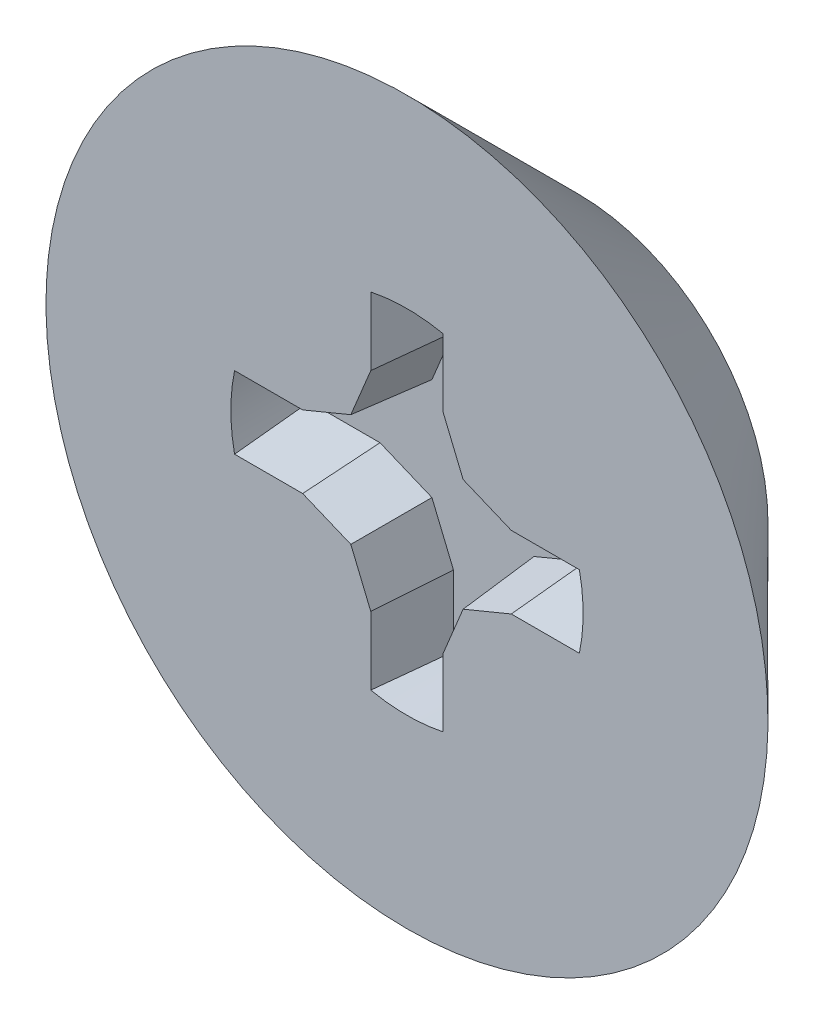
ISO-10303-21;
HEADER;
FILE_DESCRIPTION(('STEP AP214'),'2;1');
FILE_NAME('part.step','',(''),(''),'','','');
FILE_SCHEMA(('AUTOMOTIVE_DESIGN { 1 0 10303 214 1 1 1 1 }'));
ENDSEC;
DATA;
#1=APPLICATION_CONTEXT('core data for automotive mechanical design processes');
#2=APPLICATION_PROTOCOL_DEFINITION('international standard','automotive_design',2000,#1);
#3=PRODUCT_CONTEXT('',#1,'mechanical');
#4=PRODUCT('Part','Part','',(#3));
#5=PRODUCT_RELATED_PRODUCT_CATEGORY('part','',(#4));
#6=PRODUCT_DEFINITION_FORMATION('','',#4);
#7=PRODUCT_DEFINITION_CONTEXT('part definition',#1,'design');
#8=PRODUCT_DEFINITION('design','',#6,#7);
#9=PRODUCT_DEFINITION_SHAPE('','',#8);
#10=(LENGTH_UNIT() NAMED_UNIT(*) SI_UNIT(.MILLI.,.METRE.));
#11=(NAMED_UNIT(*) PLANE_ANGLE_UNIT() SI_UNIT($,.RADIAN.));
#12=(NAMED_UNIT(*) SI_UNIT($,.STERADIAN.) SOLID_ANGLE_UNIT());
#13=UNCERTAINTY_MEASURE_WITH_UNIT(LENGTH_MEASURE(1.E-05),#10,'distance_accuracy_value','');
#14=(GEOMETRIC_REPRESENTATION_CONTEXT(3) GLOBAL_UNCERTAINTY_ASSIGNED_CONTEXT((#13)) GLOBAL_UNIT_ASSIGNED_CONTEXT((#10,
#11,#12)) REPRESENTATION_CONTEXT('',''));
#15=CARTESIAN_POINT('',(0.,0.,0.));
#16=DIRECTION('',(0.,0.,1.));
#17=DIRECTION('',(1.,0.,0.));
#18=AXIS2_PLACEMENT_3D('',#15,#16,#17);
#19=CARTESIAN_POINT('',(0.,0.,1.2));
#20=DIRECTION('',(0.,0.,-1.));
#21=DIRECTION('',(0.,1.,0.));
#22=AXIS2_PLACEMENT_3D('',#19,#20,#21);
#23=PLANE('',#22);
#24=CARTESIAN_POINT('',(0.,0.,1.2));
#25=DIRECTION('',(0.,0.,1.));
#26=DIRECTION('',(0.,-1.,0.));
#27=AXIS2_PLACEMENT_3D('',#24,#25,#26);
#28=CIRCLE('',#27,1.9);
#29=CARTESIAN_POINT('',(0.,-1.9,1.2));
#30=VERTEX_POINT('',#29);
#31=EDGE_CURVE('E49',#30,#30,#28,.T.);
#32=ORIENTED_EDGE('',*,*,#31,.T.);
#33=EDGE_LOOP('',(#32));
#34=FACE_BOUND('',#33,.T.);
#35=CARTESIAN_POINT('',(0.,0.,1.2));
#36=DIRECTION('',(0.,0.,1.));
#37=DIRECTION('',(1.,0.,0.));
#38=AXIS2_PLACEMENT_3D('',#35,#36,#37);
#39=CIRCLE('',#38,0.927100000000001);
#40=CARTESIAN_POINT('',(0.90731701185418,-0.190500000000004,1.2));
#41=VERTEX_POINT('',#40);
#42=CARTESIAN_POINT('',(0.907317011854182,0.190500000000001,1.2));
#43=VERTEX_POINT('',#42);
#44=EDGE_CURVE('E260',#41,#43,#39,.T.);
#45=ORIENTED_EDGE('',*,*,#44,.F.);
#46=DIRECTION('',(-1.,0.,0.));
#47=VECTOR('',#46,1.);
#48=CARTESIAN_POINT('',(0.,-0.190500000000001,1.2));
#49=LINE('',#48,#47);
#50=CARTESIAN_POINT('',(0.54890850592709,-0.190500000000003,1.2));
#51=VERTEX_POINT('',#50);
#52=EDGE_CURVE('E251',#41,#51,#49,.T.);
#53=ORIENTED_EDGE('',*,*,#52,.T.);
#54=DIRECTION('',(-0.923879532511288,-0.382683432365088,0.));
#55=VECTOR('',#54,1.);
#56=CARTESIAN_POINT('',(0.147737710475553,-0.356670384304032,1.2));
#57=LINE('',#56,#55);
#58=CARTESIAN_POINT('',(0.295475420951106,-0.295475420951108,1.2));
#59=VERTEX_POINT('',#58);
#60=EDGE_CURVE('E247',#51,#59,#57,.T.);
#61=ORIENTED_EDGE('',*,*,#60,.T.);
#62=DIRECTION('',(-0.382683432365094,-0.923879532511285,0.));
#63=VECTOR('',#62,1.);
#64=CARTESIAN_POINT('',(0.356670384304031,-0.147737710475555,1.2));
#65=LINE('',#64,#63);
#66=CARTESIAN_POINT('',(0.190499999999999,-0.548908505927092,1.2));
#67=VERTEX_POINT('',#66);
#68=EDGE_CURVE('E243',#59,#67,#65,.T.);
#69=ORIENTED_EDGE('',*,*,#68,.T.);
#70=DIRECTION('',(0.,1.,0.));
#71=VECTOR('',#70,1.);
#72=CARTESIAN_POINT('',(0.190500000000001,0.,1.2));
#73=LINE('',#72,#71);
#74=CARTESIAN_POINT('',(0.190499999999998,-0.907317011854183,1.2));
#75=VERTEX_POINT('',#74);
#76=EDGE_CURVE('E239',#75,#67,#73,.T.);
#77=ORIENTED_EDGE('',*,*,#76,.F.);
#78=CARTESIAN_POINT('',(0.,0.,1.2));
#79=DIRECTION('',(0.,0.,1.));
#80=DIRECTION('',(0.,-1.,0.));
#81=AXIS2_PLACEMENT_3D('',#78,#79,#80);
#82=CIRCLE('',#81,0.927100000000001);
#83=CARTESIAN_POINT('',(-0.190500000000001,-0.907317011854181,1.2));
#84=VERTEX_POINT('',#83);
#85=EDGE_CURVE('E234',#84,#75,#82,.T.);
#86=ORIENTED_EDGE('',*,*,#85,.F.);
#87=DIRECTION('',(0.,1.,0.));
#88=VECTOR('',#87,1.);
#89=CARTESIAN_POINT('',(-0.190500000000001,0.,1.2));
#90=LINE('',#89,#88);
#91=CARTESIAN_POINT('',(-0.190500000000001,-0.548908505927091,1.2));
#92=VERTEX_POINT('',#91);
#93=EDGE_CURVE('E230',#84,#92,#90,.T.);
#94=ORIENTED_EDGE('',*,*,#93,.T.);
#95=DIRECTION('',(-0.382683432365091,0.923879532511286,0.));
#96=VECTOR('',#95,1.);
#97=CARTESIAN_POINT('',(-0.356670384304031,-0.147737710475554,1.2));
#98=LINE('',#97,#96);
#99=CARTESIAN_POINT('',(-0.295475420951107,-0.295475420951107,1.2));
#100=VERTEX_POINT('',#99);
#101=EDGE_CURVE('E226',#92,#100,#98,.T.);
#102=ORIENTED_EDGE('',*,*,#101,.T.);
#103=DIRECTION('',(-0.923879532511287,0.38268343236509,0.));
#104=VECTOR('',#103,1.);
#105=CARTESIAN_POINT('',(-0.147737710475554,-0.356670384304031,1.2));
#106=LINE('',#105,#104);
#107=CARTESIAN_POINT('',(-0.548908505927092,-0.190500000000001,1.2));
#108=VERTEX_POINT('',#107);
#109=EDGE_CURVE('E222',#100,#108,#106,.T.);
#110=ORIENTED_EDGE('',*,*,#109,.T.);
#111=DIRECTION('',(1.,0.,0.));
#112=VECTOR('',#111,1.);
#113=CARTESIAN_POINT('',(0.,-0.190500000000001,1.2));
#114=LINE('',#113,#112);
#115=CARTESIAN_POINT('',(-0.907317011854182,-0.190500000000001,1.2));
#116=VERTEX_POINT('',#115);
#117=EDGE_CURVE('E218',#116,#108,#114,.T.);
#118=ORIENTED_EDGE('',*,*,#117,.F.);
#119=CARTESIAN_POINT('',(0.,0.,1.2));
#120=DIRECTION('',(0.,0.,1.));
#121=DIRECTION('',(-1.,0.,0.));
#122=AXIS2_PLACEMENT_3D('',#119,#120,#121);
#123=CIRCLE('',#122,0.927100000000001);
#124=CARTESIAN_POINT('',(-0.907317011854179,0.190500000000011,1.2));
#125=VERTEX_POINT('',#124);
#126=EDGE_CURVE('E213',#125,#116,#123,.T.);
#127=ORIENTED_EDGE('',*,*,#126,.F.);
#128=DIRECTION('',(1.,0.,0.));
#129=VECTOR('',#128,1.);
#130=CARTESIAN_POINT('',(0.,0.190500000000001,1.2));
#131=LINE('',#130,#129);
#132=CARTESIAN_POINT('',(-0.548908505927089,0.190500000000007,1.2));
#133=VERTEX_POINT('',#132);
#134=EDGE_CURVE('E209',#125,#133,#131,.T.);
#135=ORIENTED_EDGE('',*,*,#134,.T.);
#136=DIRECTION('',(0.92387953251129,0.382683432365081,0.));
#137=VECTOR('',#136,1.);
#138=CARTESIAN_POINT('',(-0.14773771047555,0.356670384304033,1.2));
#139=LINE('',#138,#137);
#140=CARTESIAN_POINT('',(-0.295475420951104,0.29547542095111,1.2));
#141=VERTEX_POINT('',#140);
#142=EDGE_CURVE('E206',#133,#141,#139,.T.);
#143=ORIENTED_EDGE('',*,*,#142,.T.);
#144=DIRECTION('',(0.3826834323651,0.923879532511283,0.));
#145=VECTOR('',#144,1.);
#146=CARTESIAN_POINT('',(-0.35667038430403,0.147737710475558,1.2));
#147=LINE('',#146,#145);
#148=CARTESIAN_POINT('',(-0.190499999999995,0.548908505927094,1.2));
#149=VERTEX_POINT('',#148);
#150=EDGE_CURVE('E199',#141,#149,#147,.T.);
#151=ORIENTED_EDGE('',*,*,#150,.T.);
#152=DIRECTION('',(0.,-1.,0.));
#153=VECTOR('',#152,1.);
#154=CARTESIAN_POINT('',(-0.190500000000001,0.,1.2));
#155=LINE('',#154,#153);
#156=CARTESIAN_POINT('',(-0.190499999999992,0.907317011854184,1.2));
#157=VERTEX_POINT('',#156);
#158=EDGE_CURVE('E192',#157,#149,#155,.T.);
#159=ORIENTED_EDGE('',*,*,#158,.F.);
#160=CARTESIAN_POINT('',(0.,0.,1.2));
#161=DIRECTION('',(0.,0.,1.));
#162=DIRECTION('',(1.,0.,0.));
#163=AXIS2_PLACEMENT_3D('',#160,#161,#162);
#164=CIRCLE('',#163,0.9271);
#165=CARTESIAN_POINT('',(0.190500000000001,0.907317011854181,1.2));
#166=VERTEX_POINT('',#165);
#167=EDGE_CURVE('E177',#157,#166,#164,.F.);
#168=ORIENTED_EDGE('',*,*,#167,.T.);
#169=DIRECTION('',(0.,-1.,0.));
#170=VECTOR('',#169,1.);
#171=CARTESIAN_POINT('',(0.190500000000001,0.,1.2));
#172=LINE('',#171,#170);
#173=CARTESIAN_POINT('',(0.190500000000001,0.548908505927091,1.2));
#174=VERTEX_POINT('',#173);
#175=EDGE_CURVE('E186',#166,#174,#172,.T.);
#176=ORIENTED_EDGE('',*,*,#175,.T.);
#177=DIRECTION('',(0.382683432365091,-0.923879532511286,0.));
#178=VECTOR('',#177,1.);
#179=CARTESIAN_POINT('',(0.356670384304031,0.147737710475554,1.2));
#180=LINE('',#179,#178);
#181=CARTESIAN_POINT('',(0.295475420951107,0.295475420951107,1.2));
#182=VERTEX_POINT('',#181);
#183=EDGE_CURVE('E269',#174,#182,#180,.T.);
#184=ORIENTED_EDGE('',*,*,#183,.T.);
#185=DIRECTION('',(0.923879532511287,-0.38268343236509,0.));
#186=VECTOR('',#185,1.);
#187=CARTESIAN_POINT('',(0.147737710475554,0.356670384304031,1.2));
#188=LINE('',#187,#186);
#189=CARTESIAN_POINT('',(0.548908505927092,0.190500000000001,1.2));
#190=VERTEX_POINT('',#189);
#191=EDGE_CURVE('E266',#182,#190,#188,.T.);
#192=ORIENTED_EDGE('',*,*,#191,.T.);
#193=DIRECTION('',(-1.,0.,0.));
#194=VECTOR('',#193,1.);
#195=CARTESIAN_POINT('',(0.,0.190500000000001,1.2));
#196=LINE('',#195,#194);
#197=EDGE_CURVE('E263',#43,#190,#196,.T.);
#198=ORIENTED_EDGE('',*,*,#197,.F.);
#199=EDGE_LOOP('',(#45,#53,#61,#69,#77,#86,#94,#102,#110,#118,#127,#135,#143,#151,#159,#168,
#176,#184,#192,#198));
#200=FACE_BOUND('',#199,.T.);
#201=ADVANCED_FACE('F40',(#34,#200),#23,.F.);
#202=CARTESIAN_POINT('',(0.,0.,0.3));
#203=DIRECTION('',(0.,0.,1.));
#204=DIRECTION('',(0.,-1.,0.));
#205=AXIS2_PLACEMENT_3D('',#202,#203,#204);
#206=PLANE('',#205);
#207=CARTESIAN_POINT('',(0.,0.,0.3));
#208=DIRECTION('',(0.,0.,1.));
#209=DIRECTION('',(0.,-1.,0.));
#210=AXIS2_PLACEMENT_3D('',#207,#208,#209);
#211=CIRCLE('',#210,1.);
#212=CARTESIAN_POINT('',(0.,-1.,0.299999999999999));
#213=VERTEX_POINT('',#212);
#214=EDGE_CURVE('E11',#213,#213,#211,.T.);
#215=ORIENTED_EDGE('',*,*,#214,.F.);
#216=EDGE_LOOP('',(#215));
#217=FACE_BOUND('',#216,.T.);
#218=ADVANCED_FACE('F420',(#217),#206,.F.);
#219=CARTESIAN_POINT('',(0.,0.,0.3));
#220=DIRECTION('',(0.,0.,1.));
#221=DIRECTION('',(0.,-1.,0.));
#222=AXIS2_PLACEMENT_3D('',#219,#220,#221);
#223=CONICAL_SURFACE('',#222,1.,0.785398163397448);
#224=ORIENTED_EDGE('',*,*,#31,.F.);
#225=EDGE_LOOP('',(#224));
#226=FACE_BOUND('',#225,.T.);
#227=ORIENTED_EDGE('',*,*,#214,.T.);
#228=EDGE_LOOP('',(#227));
#229=FACE_BOUND('',#228,.T.);
#230=ADVANCED_FACE('F425',(#226,#229),#223,.T.);
#231=CARTESIAN_POINT('',(0.,0.,0.8));
#232=DIRECTION('',(0.,0.,1.));
#233=DIRECTION('',(1.,0.,0.));
#234=AXIS2_PLACEMENT_3D('',#231,#232,#233);
#235=CYLINDRICAL_SURFACE('',#234,0.9271);
#236=ORIENTED_EDGE('',*,*,#167,.F.);
#237=CARTESIAN_POINT('',(0.,0.,-0.977424963676043));
#238=DIRECTION('',(0.996194698091746,0.,0.0871557427476584));
#239=DIRECTION('',(-0.0871557427476584,0.,0.996194698091746));
#240=AXIS2_PLACEMENT_3D('',#237,#238,#239);
#241=ELLIPSE('',#240,10.6372795500605,0.9271);
#242=CARTESIAN_POINT('',(-0.155504534589622,0.913965398536545,0.8));
#243=VERTEX_POINT('',#242);
#244=EDGE_CURVE('E180',#243,#157,#241,.T.);
#245=ORIENTED_EDGE('',*,*,#244,.F.);
#246=CARTESIAN_POINT('',(0.,0.,0.8));
#247=DIRECTION('',(0.,0.,1.));
#248=DIRECTION('',(1.,0.,0.));
#249=AXIS2_PLACEMENT_3D('',#246,#247,#248);
#250=CIRCLE('',#249,0.9271);
#251=CARTESIAN_POINT('',(0.155504534589632,0.913965398536543,0.8));
#252=VERTEX_POINT('',#251);
#253=EDGE_CURVE('E57',#243,#252,#250,.F.);
#254=ORIENTED_EDGE('',*,*,#253,.T.);
#255=CARTESIAN_POINT('',(0.,0.,-0.977424963676048));
#256=DIRECTION('',(-0.996194698091746,0.,0.0871557427476584));
#257=DIRECTION('',(0.0871557427476584,0.,0.996194698091746));
#258=AXIS2_PLACEMENT_3D('',#255,#256,#257);
#259=ELLIPSE('',#258,10.6372795500605,0.9271);
#260=EDGE_CURVE('E44',#252,#166,#259,.F.);
#261=ORIENTED_EDGE('',*,*,#260,.T.);
#262=EDGE_LOOP('',(#236,#245,#254,#261));
#263=FACE_BOUND('',#262,.T.);
#264=ADVANCED_FACE('F179',(#263),#235,.F.);
#265=CARTESIAN_POINT('',(0.190500000000001,0.,1.2));
#266=DIRECTION('',(-0.996194698091746,0.,0.0871557427476584));
#267=DIRECTION('',(0.0871557427476584,0.,0.996194698091746));
#268=AXIS2_PLACEMENT_3D('',#265,#266,#267);
#269=PLANE('',#268);
#270=ORIENTED_EDGE('',*,*,#175,.F.);
#271=ORIENTED_EDGE('',*,*,#260,.F.);
#272=DIRECTION('',(0.,-1.,0.));
#273=VECTOR('',#272,1.);
#274=CARTESIAN_POINT('',(0.155504534589632,0.,0.8));
#275=LINE('',#274,#273);
#276=CARTESIAN_POINT('',(0.155504534589632,0.541947475054761,0.8));
#277=VERTEX_POINT('',#276);
#278=EDGE_CURVE('E64',#252,#277,#275,.T.);
#279=ORIENTED_EDGE('',*,*,#278,.T.);
#280=DIRECTION('',(0.0871426484044397,0.0173337504938602,0.996045029063886));
#281=VECTOR('',#280,1.);
#282=CARTESIAN_POINT('',(0.189670868802891,0.548743581477805,1.19052298705117));
#283=LINE('',#282,#281);
#284=EDGE_CURVE('E330',#277,#174,#283,.T.);
#285=ORIENTED_EDGE('',*,*,#284,.T.);
#286=EDGE_LOOP('',(#270,#271,#279,#285));
#287=FACE_BOUND('',#286,.T.);
#288=ADVANCED_FACE('F359',(#287),#269,.T.);
#289=CARTESIAN_POINT('',(0.356670384304031,0.147737710475554,1.2));
#290=DIRECTION('',(-0.920363891963224,-0.381227206369655,0.0871557427476583));
#291=DIRECTION('',(0.382683432365091,-0.923879532511286,0.));
#292=AXIS2_PLACEMENT_3D('',#289,#290,#291);
#293=PLANE('',#292);
#294=ORIENTED_EDGE('',*,*,#183,.F.);
#295=ORIENTED_EDGE('',*,*,#284,.F.);
#296=DIRECTION('',(0.382683432365091,-0.923879532511286,0.));
#297=VECTOR('',#296,1.);
#298=CARTESIAN_POINT('',(0.324338790080684,0.1343455256551,0.8));
#299=LINE('',#298,#297);
#300=CARTESIAN_POINT('',(0.268691051310199,0.268691051310199,0.8));
#301=VERTEX_POINT('',#300);
#302=EDGE_CURVE('E341',#277,#301,#299,.T.);
#303=ORIENTED_EDGE('',*,*,#302,.T.);
#304=DIRECTION('',(0.0666626913468323,0.0666626913468322,0.995546167269401));
#305=VECTOR('',#304,1.);
#306=CARTESIAN_POINT('',(0.29509083238943,0.29509083238943,1.1942565224893));
#307=LINE('',#306,#305);
#308=EDGE_CURVE('E332',#301,#182,#307,.T.);
#309=ORIENTED_EDGE('',*,*,#308,.T.);
#310=EDGE_LOOP('',(#294,#295,#303,#309));
#311=FACE_BOUND('',#310,.T.);
#312=ADVANCED_FACE('F346',(#311),#293,.T.);
#313=CARTESIAN_POINT('',(0.147737710475554,0.356670384304031,1.2));
#314=DIRECTION('',(-0.381227206369654,-0.920363891963224,0.0871557427476582));
#315=DIRECTION('',(0.923879532511287,-0.38268343236509,0.));
#316=AXIS2_PLACEMENT_3D('',#313,#314,#315);
#317=PLANE('',#316);
#318=ORIENTED_EDGE('',*,*,#191,.F.);
#319=ORIENTED_EDGE('',*,*,#308,.F.);
#320=DIRECTION('',(0.923879532511287,-0.38268343236509,0.));
#321=VECTOR('',#320,1.);
#322=CARTESIAN_POINT('',(0.1343455256551,0.324338790080684,0.8));
#323=LINE('',#322,#321);
#324=CARTESIAN_POINT('',(0.541947475054762,0.155504534589631,0.8));
#325=VERTEX_POINT('',#324);
#326=EDGE_CURVE('E339',#301,#325,#323,.T.);
#327=ORIENTED_EDGE('',*,*,#326,.T.);
#328=DIRECTION('',(-0.0173337504938603,-0.0871426484044395,-0.996045029063886));
#329=VECTOR('',#328,1.);
#330=CARTESIAN_POINT('',(0.548743581477806,0.18967086880289,1.19052298705117));
#331=LINE('',#330,#329);
#332=EDGE_CURVE('E334',#325,#190,#331,.F.);
#333=ORIENTED_EDGE('',*,*,#332,.T.);
#334=EDGE_LOOP('',(#318,#319,#327,#333));
#335=FACE_BOUND('',#334,.T.);
#336=ADVANCED_FACE('F351',(#335),#317,.T.);
#337=CARTESIAN_POINT('',(0.,0.190500000000001,1.2));
#338=DIRECTION('',(0.,-0.996194698091746,0.0871557427476582));
#339=DIRECTION('',(0.,-0.0871557427476582,-0.996194698091746));
#340=AXIS2_PLACEMENT_3D('',#337,#338,#339);
#341=PLANE('',#340);
#342=ORIENTED_EDGE('',*,*,#197,.T.);
#343=ORIENTED_EDGE('',*,*,#332,.F.);
#344=DIRECTION('',(1.,0.,0.));
#345=VECTOR('',#344,1.);
#346=CARTESIAN_POINT('',(0.,0.155504534589631,0.8));
#347=LINE('',#346,#345);
#348=CARTESIAN_POINT('',(0.913965398536544,0.155504534589631,0.8));
#349=VERTEX_POINT('',#348);
#350=EDGE_CURVE('E257',#349,#325,#347,.F.);
#351=ORIENTED_EDGE('',*,*,#350,.F.);
#352=CARTESIAN_POINT('',(0.,0.,-0.977424963676048));
#353=DIRECTION('',(0.,-0.996194698091746,0.0871557427476582));
#354=DIRECTION('',(0.,0.0871557427476582,0.996194698091746));
#355=AXIS2_PLACEMENT_3D('',#352,#353,#354);
#356=ELLIPSE('',#355,10.6372795500605,0.927100000000001);
#357=EDGE_CURVE('E259',#349,#43,#356,.T.);
#358=ORIENTED_EDGE('',*,*,#357,.T.);
#359=EDGE_LOOP('',(#342,#343,#351,#358));
#360=FACE_BOUND('',#359,.T.);
#361=ADVANCED_FACE('F357',(#360),#341,.T.);
#362=CARTESIAN_POINT('',(0.,0.,0.8));
#363=DIRECTION('',(0.,0.,1.));
#364=DIRECTION('',(1.,0.,0.));
#365=AXIS2_PLACEMENT_3D('',#362,#363,#364);
#366=CYLINDRICAL_SURFACE('',#365,0.927100000000001);
#367=ORIENTED_EDGE('',*,*,#44,.T.);
#368=ORIENTED_EDGE('',*,*,#357,.F.);
#369=CARTESIAN_POINT('',(0.,0.,0.8));
#370=DIRECTION('',(0.,0.,1.));
#371=DIRECTION('',(1.,0.,0.));
#372=AXIS2_PLACEMENT_3D('',#369,#370,#371);
#373=CIRCLE('',#372,0.927100000000001);
#374=CARTESIAN_POINT('',(0.913965398536544,-0.155504534589635,0.8));
#375=VERTEX_POINT('',#374);
#376=EDGE_CURVE('E185',#375,#349,#373,.T.);
#377=ORIENTED_EDGE('',*,*,#376,.F.);
#378=CARTESIAN_POINT('',(0.,0.,-0.977424963676043));
#379=DIRECTION('',(0.,0.996194698091746,0.0871557427476585));
#380=DIRECTION('',(0.,-0.0871557427476585,0.996194698091746));
#381=AXIS2_PLACEMENT_3D('',#378,#379,#380);
#382=ELLIPSE('',#381,10.6372795500605,0.927100000000001);
#383=EDGE_CURVE('E254',#375,#41,#382,.F.);
#384=ORIENTED_EDGE('',*,*,#383,.T.);
#385=EDGE_LOOP('',(#367,#368,#377,#384));
#386=FACE_BOUND('',#385,.T.);
#387=ADVANCED_FACE('F408',(#386),#366,.F.);
#388=CARTESIAN_POINT('',(0.,0.,0.8));
#389=DIRECTION('',(0.,0.,1.));
#390=DIRECTION('',(1.,0.,0.));
#391=AXIS2_PLACEMENT_3D('',#388,#389,#390);
#392=PLANE('',#391);
#393=DIRECTION('',(-1.,0.,0.));
#394=VECTOR('',#393,1.);
#395=CARTESIAN_POINT('',(0.,-0.155504534589632,0.8));
#396=LINE('',#395,#394);
#397=CARTESIAN_POINT('',(0.541947475054761,-0.155504534589633,0.8));
#398=VERTEX_POINT('',#397);
#399=EDGE_CURVE('E318',#375,#398,#396,.T.);
#400=ORIENTED_EDGE('',*,*,#399,.F.);
#401=ORIENTED_EDGE('',*,*,#376,.T.);
#402=ORIENTED_EDGE('',*,*,#350,.T.);
#403=ORIENTED_EDGE('',*,*,#326,.F.);
#404=ORIENTED_EDGE('',*,*,#302,.F.);
#405=ORIENTED_EDGE('',*,*,#278,.F.);
#406=ORIENTED_EDGE('',*,*,#253,.F.);
#407=DIRECTION('',(0.,1.,0.));
#408=VECTOR('',#407,1.);
#409=CARTESIAN_POINT('',(-0.155504534589631,0.,0.8));
#410=LINE('',#409,#408);
#411=CARTESIAN_POINT('',(-0.155504534589626,0.541947475054764,0.8));
#412=VERTEX_POINT('',#411);
#413=EDGE_CURVE('E194',#243,#412,#410,.F.);
#414=ORIENTED_EDGE('',*,*,#413,.T.);
#415=DIRECTION('',(0.3826834323651,0.923879532511283,0.));
#416=VECTOR('',#415,1.);
#417=CARTESIAN_POINT('',(-0.324338790080683,0.134345525655103,0.8));
#418=LINE('',#417,#416);
#419=CARTESIAN_POINT('',(-0.268691051310196,0.268691051310202,0.8));
#420=VERTEX_POINT('',#419);
#421=EDGE_CURVE('E280',#420,#412,#418,.T.);
#422=ORIENTED_EDGE('',*,*,#421,.F.);
#423=DIRECTION('',(0.92387953251129,0.382683432365081,0.));
#424=VECTOR('',#423,1.);
#425=CARTESIAN_POINT('',(-0.134345525655097,0.324338790080686,0.8));
#426=LINE('',#425,#424);
#427=CARTESIAN_POINT('',(-0.54194747505476,0.155504534589637,0.8));
#428=VERTEX_POINT('',#427);
#429=EDGE_CURVE('E283',#428,#420,#426,.T.);
#430=ORIENTED_EDGE('',*,*,#429,.F.);
#431=DIRECTION('',(1.,0.,0.));
#432=VECTOR('',#431,1.);
#433=CARTESIAN_POINT('',(0.,0.155504534589632,0.8));
#434=LINE('',#433,#432);
#435=CARTESIAN_POINT('',(-0.913965398536543,0.155504534589641,0.8));
#436=VERTEX_POINT('',#435);
#437=EDGE_CURVE('E195',#436,#428,#434,.T.);
#438=ORIENTED_EDGE('',*,*,#437,.F.);
#439=CARTESIAN_POINT('',(0.,0.,0.8));
#440=DIRECTION('',(0.,0.,1.));
#441=DIRECTION('',(-1.,0.,0.));
#442=AXIS2_PLACEMENT_3D('',#439,#440,#441);
#443=CIRCLE('',#442,0.927100000000001);
#444=CARTESIAN_POINT('',(-0.913965398536544,-0.155504534589631,0.8));
#445=VERTEX_POINT('',#444);
#446=EDGE_CURVE('E215',#436,#445,#443,.T.);
#447=ORIENTED_EDGE('',*,*,#446,.T.);
#448=DIRECTION('',(-1.,0.,0.));
#449=VECTOR('',#448,1.);
#450=CARTESIAN_POINT('',(0.,-0.155504534589631,0.8));
#451=LINE('',#450,#449);
#452=CARTESIAN_POINT('',(-0.541947475054762,-0.155504534589631,0.8));
#453=VERTEX_POINT('',#452);
#454=EDGE_CURVE('E217',#445,#453,#451,.F.);
#455=ORIENTED_EDGE('',*,*,#454,.T.);
#456=DIRECTION('',(-0.923879532511287,0.38268343236509,0.));
#457=VECTOR('',#456,1.);
#458=CARTESIAN_POINT('',(-0.1343455256551,-0.324338790080684,0.8));
#459=LINE('',#458,#457);
#460=CARTESIAN_POINT('',(-0.268691051310199,-0.268691051310199,0.8));
#461=VERTEX_POINT('',#460);
#462=EDGE_CURVE('E300',#461,#453,#459,.T.);
#463=ORIENTED_EDGE('',*,*,#462,.F.);
#464=DIRECTION('',(-0.382683432365091,0.923879532511286,0.));
#465=VECTOR('',#464,1.);
#466=CARTESIAN_POINT('',(-0.324338790080684,-0.1343455256551,0.8));
#467=LINE('',#466,#465);
#468=CARTESIAN_POINT('',(-0.155504534589632,-0.541947475054761,0.8));
#469=VERTEX_POINT('',#468);
#470=EDGE_CURVE('E303',#469,#461,#467,.T.);
#471=ORIENTED_EDGE('',*,*,#470,.F.);
#472=DIRECTION('',(0.,1.,0.));
#473=VECTOR('',#472,1.);
#474=CARTESIAN_POINT('',(-0.155504534589632,0.,0.8));
#475=LINE('',#474,#473);
#476=CARTESIAN_POINT('',(-0.155504534589632,-0.913965398536544,0.8));
#477=VERTEX_POINT('',#476);
#478=EDGE_CURVE('E298',#477,#469,#475,.T.);
#479=ORIENTED_EDGE('',*,*,#478,.F.);
#480=CARTESIAN_POINT('',(0.,0.,0.8));
#481=DIRECTION('',(0.,0.,1.));
#482=DIRECTION('',(0.,-1.,0.));
#483=AXIS2_PLACEMENT_3D('',#480,#481,#482);
#484=CIRCLE('',#483,0.927100000000001);
#485=CARTESIAN_POINT('',(0.155504534589628,-0.913965398536545,0.8));
#486=VERTEX_POINT('',#485);
#487=EDGE_CURVE('E236',#477,#486,#484,.T.);
#488=ORIENTED_EDGE('',*,*,#487,.T.);
#489=DIRECTION('',(0.,-1.,0.));
#490=VECTOR('',#489,1.);
#491=CARTESIAN_POINT('',(0.155504534589631,0.,0.8));
#492=LINE('',#491,#490);
#493=CARTESIAN_POINT('',(0.155504534589629,-0.541947475054763,0.8));
#494=VERTEX_POINT('',#493);
#495=EDGE_CURVE('E238',#486,#494,#492,.F.);
#496=ORIENTED_EDGE('',*,*,#495,.T.);
#497=DIRECTION('',(-0.382683432365094,-0.923879532511285,0.));
#498=VECTOR('',#497,1.);
#499=CARTESIAN_POINT('',(0.324338790080683,-0.134345525655101,0.8));
#500=LINE('',#499,#498);
#501=CARTESIAN_POINT('',(0.268691051310198,-0.2686910513102,0.8));
#502=VERTEX_POINT('',#501);
#503=EDGE_CURVE('E320',#502,#494,#500,.T.);
#504=ORIENTED_EDGE('',*,*,#503,.F.);
#505=DIRECTION('',(-0.923879532511288,-0.382683432365088,0.));
#506=VECTOR('',#505,1.);
#507=CARTESIAN_POINT('',(0.134345525655099,-0.324338790080685,0.8));
#508=LINE('',#507,#506);
#509=EDGE_CURVE('E323',#398,#502,#508,.T.);
#510=ORIENTED_EDGE('',*,*,#509,.F.);
#511=EDGE_LOOP('',(#400,#401,#402,#403,#404,#405,#406,#414,#422,#430,#438,#447,#455,#463,#471,
#479,#488,#496,#504,#510));
#512=FACE_BOUND('',#511,.T.);
#513=ADVANCED_FACE('F354',(#512),#392,.T.);
#514=CARTESIAN_POINT('',(0.,-0.190500000000001,1.2));
#515=DIRECTION('',(0.,0.996194698091746,0.0871557427476585));
#516=DIRECTION('',(0.,-0.0871557427476585,0.996194698091746));
#517=AXIS2_PLACEMENT_3D('',#514,#515,#516);
#518=PLANE('',#517);
#519=ORIENTED_EDGE('',*,*,#52,.F.);
#520=ORIENTED_EDGE('',*,*,#383,.F.);
#521=ORIENTED_EDGE('',*,*,#399,.T.);
#522=DIRECTION('',(0.01733375049386,-0.0871426484044399,0.996045029063886));
#523=VECTOR('',#522,1.);
#524=CARTESIAN_POINT('',(0.548743581477805,-0.189670868802893,1.19052298705117));
#525=LINE('',#524,#523);
#526=EDGE_CURVE('E250',#398,#51,#525,.T.);
#527=ORIENTED_EDGE('',*,*,#526,.T.);
#528=EDGE_LOOP('',(#519,#520,#521,#527));
#529=FACE_BOUND('',#528,.T.);
#530=ADVANCED_FACE('F405',(#529),#518,.T.);
#531=CARTESIAN_POINT('',(0.147737710475553,-0.356670384304032,1.2));
#532=DIRECTION('',(-0.381227206369652,0.920363891963225,0.0871557427476585));
#533=DIRECTION('',(-0.923879532511288,-0.382683432365088,0.));
#534=AXIS2_PLACEMENT_3D('',#531,#532,#533);
#535=PLANE('',#534);
#536=ORIENTED_EDGE('',*,*,#60,.F.);
#537=ORIENTED_EDGE('',*,*,#526,.F.);
#538=ORIENTED_EDGE('',*,*,#509,.T.);
#539=DIRECTION('',(0.0666626913468321,-0.0666626913468327,0.995546167269401));
#540=VECTOR('',#539,1.);
#541=CARTESIAN_POINT('',(0.295090832389429,-0.295090832389431,1.1942565224893));
#542=LINE('',#541,#540);
#543=EDGE_CURVE('E246',#502,#59,#542,.T.);
#544=ORIENTED_EDGE('',*,*,#543,.T.);
#545=EDGE_LOOP('',(#536,#537,#538,#544));
#546=FACE_BOUND('',#545,.T.);
#547=ADVANCED_FACE('F402',(#546),#535,.T.);
#548=CARTESIAN_POINT('',(0.356670384304031,-0.147737710475555,1.2));
#549=DIRECTION('',(-0.920363891963223,0.381227206369657,0.0871557427476584));
#550=DIRECTION('',(-0.382683432365094,-0.923879532511285,0.));
#551=AXIS2_PLACEMENT_3D('',#548,#549,#550);
#552=PLANE('',#551);
#553=ORIENTED_EDGE('',*,*,#68,.F.);
#554=ORIENTED_EDGE('',*,*,#543,.F.);
#555=ORIENTED_EDGE('',*,*,#503,.T.);
#556=DIRECTION('',(-0.0871426484044396,0.0173337504938607,-0.996045029063886));
#557=VECTOR('',#556,1.);
#558=CARTESIAN_POINT('',(0.189670868802888,-0.548743581477807,1.19052298705117));
#559=LINE('',#558,#557);
#560=EDGE_CURVE('E241',#494,#67,#559,.F.);
#561=ORIENTED_EDGE('',*,*,#560,.T.);
#562=EDGE_LOOP('',(#553,#554,#555,#561));
#563=FACE_BOUND('',#562,.T.);
#564=ADVANCED_FACE('F398',(#563),#552,.T.);
#565=CARTESIAN_POINT('',(0.190500000000001,0.,1.2));
#566=DIRECTION('',(-0.996194698091746,0.,0.0871557427476584));
#567=DIRECTION('',(0.0871557427476584,0.,0.996194698091746));
#568=AXIS2_PLACEMENT_3D('',#565,#566,#567);
#569=PLANE('',#568);
#570=ORIENTED_EDGE('',*,*,#76,.T.);
#571=ORIENTED_EDGE('',*,*,#560,.F.);
#572=ORIENTED_EDGE('',*,*,#495,.F.);
#573=CARTESIAN_POINT('',(0.,0.,-0.977424963676044));
#574=DIRECTION('',(-0.996194698091746,0.,0.0871557427476584));
#575=DIRECTION('',(0.0871557427476584,0.,0.996194698091746));
#576=AXIS2_PLACEMENT_3D('',#573,#574,#575);
#577=ELLIPSE('',#576,10.6372795500605,0.927100000000001);
#578=EDGE_CURVE('E242',#486,#75,#577,.T.);
#579=ORIENTED_EDGE('',*,*,#578,.T.);
#580=EDGE_LOOP('',(#570,#571,#572,#579));
#581=FACE_BOUND('',#580,.T.);
#582=ADVANCED_FACE('F394',(#581),#569,.T.);
#583=CARTESIAN_POINT('',(0.,0.,0.8));
#584=DIRECTION('',(0.,0.,1.));
#585=DIRECTION('',(0.,-1.,0.));
#586=AXIS2_PLACEMENT_3D('',#583,#584,#585);
#587=CYLINDRICAL_SURFACE('',#586,0.927100000000001);
#588=ORIENTED_EDGE('',*,*,#85,.T.);
#589=ORIENTED_EDGE('',*,*,#578,.F.);
#590=ORIENTED_EDGE('',*,*,#487,.F.);
#591=CARTESIAN_POINT('',(0.,0.,-0.977424963676047));
#592=DIRECTION('',(0.996194698091746,0.,0.0871557427476584));
#593=DIRECTION('',(-0.0871557427476584,0.,0.996194698091746));
#594=AXIS2_PLACEMENT_3D('',#591,#592,#593);
#595=ELLIPSE('',#594,10.6372795500605,0.927100000000001);
#596=EDGE_CURVE('E233',#477,#84,#595,.F.);
#597=ORIENTED_EDGE('',*,*,#596,.T.);
#598=EDGE_LOOP('',(#588,#589,#590,#597));
#599=FACE_BOUND('',#598,.T.);
#600=ADVANCED_FACE('F396',(#599),#587,.F.);
#601=CARTESIAN_POINT('',(-0.190500000000001,0.,1.2));
#602=DIRECTION('',(0.996194698091746,0.,0.0871557427476584));
#603=DIRECTION('',(0.0871557427476584,0.,-0.996194698091746));
#604=AXIS2_PLACEMENT_3D('',#601,#602,#603);
#605=PLANE('',#604);
#606=ORIENTED_EDGE('',*,*,#93,.F.);
#607=ORIENTED_EDGE('',*,*,#596,.F.);
#608=ORIENTED_EDGE('',*,*,#478,.T.);
#609=DIRECTION('',(-0.0871426484044397,-0.0173337504938605,0.996045029063886));
#610=VECTOR('',#609,1.);
#611=CARTESIAN_POINT('',(-0.189670868802891,-0.548743581477805,1.19052298705117));
#612=LINE('',#611,#610);
#613=EDGE_CURVE('E229',#469,#92,#612,.T.);
#614=ORIENTED_EDGE('',*,*,#613,.T.);
#615=EDGE_LOOP('',(#606,#607,#608,#614));
#616=FACE_BOUND('',#615,.T.);
#617=ADVANCED_FACE('F386',(#616),#605,.T.);
#618=CARTESIAN_POINT('',(-0.356670384304031,-0.147737710475554,1.2));
#619=DIRECTION('',(0.920363891963224,0.381227206369655,0.0871557427476584));
#620=DIRECTION('',(-0.382683432365091,0.923879532511286,0.));
#621=AXIS2_PLACEMENT_3D('',#618,#619,#620);
#622=PLANE('',#621);
#623=ORIENTED_EDGE('',*,*,#101,.F.);
#624=ORIENTED_EDGE('',*,*,#613,.F.);
#625=ORIENTED_EDGE('',*,*,#470,.T.);
#626=DIRECTION('',(-0.0666626913468323,-0.0666626913468325,0.995546167269401));
#627=VECTOR('',#626,1.);
#628=CARTESIAN_POINT('',(-0.29509083238943,-0.29509083238943,1.1942565224893));
#629=LINE('',#628,#627);
#630=EDGE_CURVE('E225',#461,#100,#629,.T.);
#631=ORIENTED_EDGE('',*,*,#630,.T.);
#632=EDGE_LOOP('',(#623,#624,#625,#631));
#633=FACE_BOUND('',#632,.T.);
#634=ADVANCED_FACE('F384',(#633),#622,.T.);
#635=CARTESIAN_POINT('',(-0.147737710475554,-0.356670384304031,1.2));
#636=DIRECTION('',(0.381227206369654,0.920363891963224,0.0871557427476585));
#637=DIRECTION('',(-0.923879532511287,0.38268343236509,0.));
#638=AXIS2_PLACEMENT_3D('',#635,#636,#637);
#639=PLANE('',#638);
#640=ORIENTED_EDGE('',*,*,#109,.F.);
#641=ORIENTED_EDGE('',*,*,#630,.F.);
#642=ORIENTED_EDGE('',*,*,#462,.T.);
#643=DIRECTION('',(0.0173337504938603,0.0871426484044399,-0.996045029063886));
#644=VECTOR('',#643,1.);
#645=CARTESIAN_POINT('',(-0.548743581477806,-0.18967086880289,1.19052298705117));
#646=LINE('',#645,#644);
#647=EDGE_CURVE('E220',#453,#108,#646,.F.);
#648=ORIENTED_EDGE('',*,*,#647,.T.);
#649=EDGE_LOOP('',(#640,#641,#642,#648));
#650=FACE_BOUND('',#649,.T.);
#651=ADVANCED_FACE('F379',(#650),#639,.T.);
#652=CARTESIAN_POINT('',(0.,-0.190500000000001,1.2));
#653=DIRECTION('',(0.,0.996194698091746,0.0871557427476585));
#654=DIRECTION('',(0.,-0.0871557427476585,0.996194698091746));
#655=AXIS2_PLACEMENT_3D('',#652,#653,#654);
#656=PLANE('',#655);
#657=ORIENTED_EDGE('',*,*,#117,.T.);
#658=ORIENTED_EDGE('',*,*,#647,.F.);
#659=ORIENTED_EDGE('',*,*,#454,.F.);
#660=CARTESIAN_POINT('',(0.,0.,-0.97742496367604));
#661=DIRECTION('',(0.,0.996194698091746,0.0871557427476585));
#662=DIRECTION('',(0.,-0.0871557427476585,0.996194698091746));
#663=AXIS2_PLACEMENT_3D('',#660,#661,#662);
#664=ELLIPSE('',#663,10.6372795500605,0.927100000000001);
#665=EDGE_CURVE('E221',#445,#116,#664,.T.);
#666=ORIENTED_EDGE('',*,*,#665,.T.);
#667=EDGE_LOOP('',(#657,#658,#659,#666));
#668=FACE_BOUND('',#667,.T.);
#669=ADVANCED_FACE('F42',(#668),#656,.T.);
#670=CARTESIAN_POINT('',(0.,0.,0.8));
#671=DIRECTION('',(0.,0.,1.));
#672=DIRECTION('',(-1.,0.,0.));
#673=AXIS2_PLACEMENT_3D('',#670,#671,#672);
#674=CYLINDRICAL_SURFACE('',#673,0.927100000000001);
#675=ORIENTED_EDGE('',*,*,#126,.T.);
#676=ORIENTED_EDGE('',*,*,#665,.F.);
#677=ORIENTED_EDGE('',*,*,#446,.F.);
#678=CARTESIAN_POINT('',(0.,0.,-0.977424963676052));
#679=DIRECTION('',(0.,-0.996194698091746,0.0871557427476582));
#680=DIRECTION('',(0.,0.0871557427476582,0.996194698091746));
#681=AXIS2_PLACEMENT_3D('',#678,#679,#680);
#682=ELLIPSE('',#681,10.6372795500605,0.927100000000001);
#683=EDGE_CURVE('E212',#436,#125,#682,.F.);
#684=ORIENTED_EDGE('',*,*,#683,.T.);
#685=EDGE_LOOP('',(#675,#676,#677,#684));
#686=FACE_BOUND('',#685,.T.);
#687=ADVANCED_FACE('F372',(#686),#674,.F.);
#688=CARTESIAN_POINT('',(0.,0.190500000000001,1.2));
#689=DIRECTION('',(0.,-0.996194698091746,0.0871557427476582));
#690=DIRECTION('',(0.,-0.0871557427476582,-0.996194698091746));
#691=AXIS2_PLACEMENT_3D('',#688,#689,#690);
#692=PLANE('',#691);
#693=ORIENTED_EDGE('',*,*,#134,.F.);
#694=ORIENTED_EDGE('',*,*,#683,.F.);
#695=ORIENTED_EDGE('',*,*,#437,.T.);
#696=DIRECTION('',(-0.0173337504938595,0.0871426484044397,0.996045029063886));
#697=VECTOR('',#696,1.);
#698=CARTESIAN_POINT('',(-0.548743581477803,0.189670868802896,1.19052298705117));
#699=LINE('',#698,#697);
#700=EDGE_CURVE('E208',#428,#133,#699,.T.);
#701=ORIENTED_EDGE('',*,*,#700,.T.);
#702=EDGE_LOOP('',(#693,#694,#695,#701));
#703=FACE_BOUND('',#702,.T.);
#704=ADVANCED_FACE('F370',(#703),#692,.T.);
#705=CARTESIAN_POINT('',(-0.14773771047555,0.356670384304033,1.2));
#706=DIRECTION('',(0.381227206369645,-0.920363891963228,0.0871557427476582));
#707=DIRECTION('',(0.92387953251129,0.382683432365081,0.));
#708=AXIS2_PLACEMENT_3D('',#705,#706,#707);
#709=PLANE('',#708);
#710=ORIENTED_EDGE('',*,*,#142,.F.);
#711=ORIENTED_EDGE('',*,*,#700,.F.);
#712=ORIENTED_EDGE('',*,*,#429,.T.);
#713=DIRECTION('',(-0.0666626913468317,0.0666626913468329,0.995546167269401));
#714=VECTOR('',#713,1.);
#715=CARTESIAN_POINT('',(-0.295090832389427,0.295090832389433,1.1942565224893));
#716=LINE('',#715,#714);
#717=EDGE_CURVE('E205',#420,#141,#716,.T.);
#718=ORIENTED_EDGE('',*,*,#717,.T.);
#719=EDGE_LOOP('',(#710,#711,#712,#718));
#720=FACE_BOUND('',#719,.T.);
#721=ADVANCED_FACE('F364',(#720),#709,.T.);
#722=CARTESIAN_POINT('',(-0.35667038430403,0.147737710475558,1.2));
#723=DIRECTION('',(0.92036389196322,-0.381227206369664,0.0871557427476583));
#724=DIRECTION('',(0.3826834323651,0.923879532511283,0.));
#725=AXIS2_PLACEMENT_3D('',#722,#723,#724);
#726=PLANE('',#725);
#727=ORIENTED_EDGE('',*,*,#150,.F.);
#728=ORIENTED_EDGE('',*,*,#717,.F.);
#729=ORIENTED_EDGE('',*,*,#421,.T.);
#730=DIRECTION('',(0.0871426484044395,-0.0173337504938611,-0.996045029063886));
#731=VECTOR('',#730,1.);
#732=CARTESIAN_POINT('',(-0.189670868802885,0.548743581477808,1.19052298705117));
#733=LINE('',#732,#731);
#734=EDGE_CURVE('E200',#412,#149,#733,.F.);
#735=ORIENTED_EDGE('',*,*,#734,.T.);
#736=EDGE_LOOP('',(#727,#728,#729,#735));
#737=FACE_BOUND('',#736,.T.);
#738=ADVANCED_FACE('F362',(#737),#726,.T.);
#739=CARTESIAN_POINT('',(-0.190500000000001,0.,1.2));
#740=DIRECTION('',(0.996194698091746,0.,0.0871557427476584));
#741=DIRECTION('',(0.0871557427476584,0.,-0.996194698091746));
#742=AXIS2_PLACEMENT_3D('',#739,#740,#741);
#743=PLANE('',#742);
#744=ORIENTED_EDGE('',*,*,#158,.T.);
#745=ORIENTED_EDGE('',*,*,#734,.F.);
#746=ORIENTED_EDGE('',*,*,#413,.F.);
#747=ORIENTED_EDGE('',*,*,#244,.T.);
#748=EDGE_LOOP('',(#744,#745,#746,#747));
#749=FACE_BOUND('',#748,.T.);
#750=ADVANCED_FACE('F190',(#749),#743,.T.);
#751=CLOSED_SHELL('',(#201,#218,#230,#264,#288,#312,#336,#361,#387,#513,#530,#547,#564,#582,
#600,#617,#634,#651,#669,#687,#704,#721,#738,#750));
#752=MANIFOLD_SOLID_BREP('B2',#751);
#753=ADVANCED_BREP_SHAPE_REPRESENTATION('',(#18,#752),#14);
#754=SHAPE_DEFINITION_REPRESENTATION(#9,#753);
ENDSEC;
END-ISO-10303-21;
